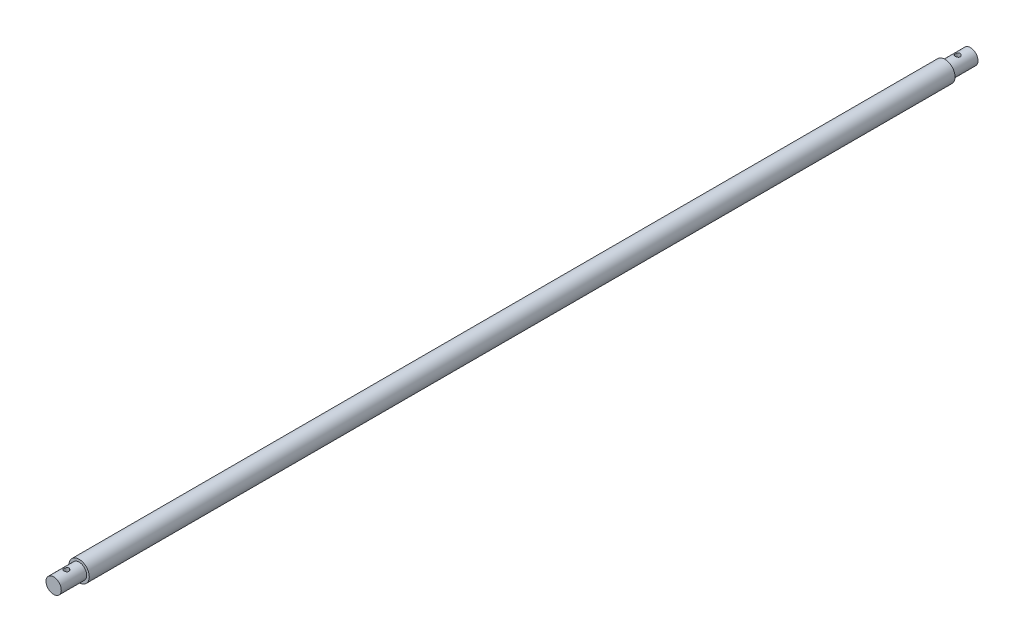
ISO-10303-21;
HEADER;
FILE_DESCRIPTION(('STEP AP214'),'2;1');
FILE_NAME('part.step','',(''),(''),'','','');
FILE_SCHEMA(('AUTOMOTIVE_DESIGN { 1 0 10303 214 1 1 1 1 }'));
ENDSEC;
DATA;
#1=APPLICATION_CONTEXT('core data for automotive mechanical design processes');
#2=APPLICATION_PROTOCOL_DEFINITION('international standard','automotive_design',2000,#1);
#3=PRODUCT_CONTEXT('',#1,'mechanical');
#4=PRODUCT('Part','Part','',(#3));
#5=PRODUCT_RELATED_PRODUCT_CATEGORY('part','',(#4));
#6=PRODUCT_DEFINITION_FORMATION('','',#4);
#7=PRODUCT_DEFINITION_CONTEXT('part definition',#1,'design');
#8=PRODUCT_DEFINITION('design','',#6,#7);
#9=PRODUCT_DEFINITION_SHAPE('','',#8);
#10=(LENGTH_UNIT() NAMED_UNIT(*) SI_UNIT(.MILLI.,.METRE.));
#11=(NAMED_UNIT(*) PLANE_ANGLE_UNIT() SI_UNIT($,.RADIAN.));
#12=(NAMED_UNIT(*) SI_UNIT($,.STERADIAN.) SOLID_ANGLE_UNIT());
#13=UNCERTAINTY_MEASURE_WITH_UNIT(LENGTH_MEASURE(1.E-05),#10,'distance_accuracy_value','');
#14=(GEOMETRIC_REPRESENTATION_CONTEXT(3) GLOBAL_UNCERTAINTY_ASSIGNED_CONTEXT((#13)) GLOBAL_UNIT_ASSIGNED_CONTEXT((#10,
#11,#12)) REPRESENTATION_CONTEXT('',''));
#15=CARTESIAN_POINT('',(0.,0.,0.));
#16=DIRECTION('',(0.,0.,1.));
#17=DIRECTION('',(1.,0.,0.));
#18=AXIS2_PLACEMENT_3D('',#15,#16,#17);
#19=CARTESIAN_POINT('',(0.,0.,350.));
#20=DIRECTION('',(0.,0.,-1.));
#21=DIRECTION('',(-1.,0.,0.));
#22=AXIS2_PLACEMENT_3D('',#19,#20,#21);
#23=CYLINDRICAL_SURFACE('',#22,4.);
#24=CARTESIAN_POINT('',(0.,0.,350.));
#25=DIRECTION('',(0.,0.,1.));
#26=DIRECTION('',(1.,0.,0.));
#27=AXIS2_PLACEMENT_3D('',#24,#25,#26);
#28=CIRCLE('',#27,4.);
#29=CARTESIAN_POINT('',(4.,0.,350.));
#30=VERTEX_POINT('',#29);
#31=EDGE_CURVE('E94',#30,#30,#28,.T.);
#32=ORIENTED_EDGE('',*,*,#31,.F.);
#33=EDGE_LOOP('',(#32));
#34=FACE_BOUND('',#33,.T.);
#35=CARTESIAN_POINT('',(0.,0.,10.));
#36=DIRECTION('',(0.,0.,-1.));
#37=DIRECTION('',(-1.,0.,0.));
#38=AXIS2_PLACEMENT_3D('',#35,#36,#37);
#39=CIRCLE('',#38,4.);
#40=CARTESIAN_POINT('',(-4.,0.,10.));
#41=VERTEX_POINT('',#40);
#42=EDGE_CURVE('E97',#41,#41,#39,.T.);
#43=ORIENTED_EDGE('',*,*,#42,.F.);
#44=EDGE_LOOP('',(#43));
#45=FACE_BOUND('',#44,.T.);
#46=ADVANCED_FACE('F33',(#34,#45),#23,.T.);
#47=CARTESIAN_POINT('',(0.,0.,360.));
#48=DIRECTION('',(0.,0.,-1.));
#49=DIRECTION('',(-1.,0.,0.));
#50=AXIS2_PLACEMENT_3D('',#47,#48,#49);
#51=CYLINDRICAL_SURFACE('',#50,3.);
#52=CARTESIAN_POINT('',(0.,0.,360.));
#53=DIRECTION('',(0.,0.,1.));
#54=DIRECTION('',(1.,0.,0.));
#55=AXIS2_PLACEMENT_3D('',#52,#53,#54);
#56=CIRCLE('',#55,3.);
#57=CARTESIAN_POINT('',(3.,0.,360.));
#58=VERTEX_POINT('',#57);
#59=EDGE_CURVE('E99',#58,#58,#56,.T.);
#60=ORIENTED_EDGE('',*,*,#59,.F.);
#61=EDGE_LOOP('',(#60));
#62=FACE_BOUND('',#61,.T.);
#63=CARTESIAN_POINT('',(0.,0.,350.));
#64=DIRECTION('',(0.,0.,1.));
#65=DIRECTION('',(1.,0.,0.));
#66=AXIS2_PLACEMENT_3D('',#63,#64,#65);
#67=CIRCLE('',#66,3.);
#68=CARTESIAN_POINT('',(3.,0.,350.));
#69=VERTEX_POINT('',#68);
#70=EDGE_CURVE('E50',#69,#69,#67,.T.);
#71=ORIENTED_EDGE('',*,*,#70,.T.);
#72=EDGE_LOOP('',(#71));
#73=FACE_BOUND('',#72,.T.);
#74=CARTESIAN_POINT('',(0.,-3.,354.));
#75=CARTESIAN_POINT('',(0.0545633628867246,-3.00000015300943,353.999999746268));
#76=CARTESIAN_POINT('',(0.109125194538551,-2.99849769507545,354.004480266127));
#77=CARTESIAN_POINT('',(0.216641760872975,-2.99265210203281,354.022229108817));
#78=CARTESIAN_POINT('',(0.269596328118821,-2.98830867202152,354.035498343949));
#79=CARTESIAN_POINT('',(0.372332789501775,-2.97725307906442,354.070319243384));
#80=CARTESIAN_POINT('',(0.422119825886028,-2.97054487730853,354.091857062459));
#81=CARTESIAN_POINT('',(0.51737493680532,-2.95544445717342,354.142541172838));
#82=CARTESIAN_POINT('',(0.562842156958707,-2.94705190667778,354.171688965003));
#83=CARTESIAN_POINT('',(0.649741675022275,-2.92914094443005,354.237825804859));
#84=CARTESIAN_POINT('',(0.691003700298319,-2.91959556463785,354.27503123426));
#85=CARTESIAN_POINT('',(0.766832692702094,-2.90060314783121,354.355767154707));
#86=CARTESIAN_POINT('',(0.801398185489472,-2.89115613290549,354.399299034929));
#87=CARTESIAN_POINT('',(0.863824942227867,-2.87313332477274,354.492985115196));
#88=CARTESIAN_POINT('',(0.891464858221039,-2.86459039275688,354.543293739732));
#89=CARTESIAN_POINT('',(0.937818873877725,-2.84975305418601,354.648176094459));
#90=CARTESIAN_POINT('',(0.956535697386764,-2.84345796160746,354.702748517163));
#91=CARTESIAN_POINT('',(0.983873461509152,-2.83411303269378,354.812673221497));
#92=CARTESIAN_POINT('',(0.992813448271757,-2.83096095769612,354.867937208489));
#93=CARTESIAN_POINT('',(1.00134112333448,-2.82795656629507,354.979263754156));
#94=CARTESIAN_POINT('',(1.00093170160473,-2.8281032302273,355.035326060709));
#95=CARTESIAN_POINT('',(0.991019903703425,-2.8315901500818,355.143936630444));
#96=CARTESIAN_POINT('',(0.981933913167002,-2.83478415867533,355.196528402919));
#97=CARTESIAN_POINT('',(0.955606162849432,-2.8437665772455,355.299393419607));
#98=CARTESIAN_POINT('',(0.938363426591883,-2.84955529784107,355.349666385435));
#99=CARTESIAN_POINT('',(0.895939058060217,-2.86317911131249,355.447412749591));
#100=CARTESIAN_POINT('',(0.870634048707269,-2.87104565793117,355.494828025469));
#101=CARTESIAN_POINT('',(0.81288910630314,-2.88792558575726,355.58487090828));
#102=CARTESIAN_POINT('',(0.780447112364001,-2.89693929790464,355.627497126933));
#103=CARTESIAN_POINT('',(0.707349332682231,-2.91567329167741,355.709091598161));
#104=CARTESIAN_POINT('',(0.666353150076308,-2.92540589354843,355.747752694509));
#105=CARTESIAN_POINT('',(0.578339569970055,-2.94406938387037,355.817731266663));
#106=CARTESIAN_POINT('',(0.531321595660798,-2.95300019538068,355.849048038164));
#107=CARTESIAN_POINT('',(0.431947613046251,-2.96917107937794,355.903696300235));
#108=CARTESIAN_POINT('',(0.379543276416329,-2.9763935000804,355.926945491341));
#109=CARTESIAN_POINT('',(0.27126908336452,-2.98820567144434,355.964203173956));
#110=CARTESIAN_POINT('',(0.21540043815498,-2.99279633654878,355.978214875423));
#111=CARTESIAN_POINT('',(0.104383829529338,-2.99867627071441,355.996055666022));
#112=CARTESIAN_POINT('',(0.0493095998648747,-3.00010001833731,356.000299809173));
#113=CARTESIAN_POINT('',(-0.0607750699602173,-2.99988902694825,355.999667326402));
#114=CARTESIAN_POINT('',(-0.115785519319633,-2.99825480419352,355.99479224002));
#115=CARTESIAN_POINT('',(-0.222519866304251,-2.99220024717114,355.976388092264));
#116=CARTESIAN_POINT('',(-0.274292806834848,-2.98786198711228,355.96311379395));
#117=CARTESIAN_POINT('',(-0.374855958579557,-2.97691846830034,355.928606555533));
#118=CARTESIAN_POINT('',(-0.423645788508559,-2.97031292046541,355.907372600532));
#119=CARTESIAN_POINT('',(-0.518288296393323,-2.95528931287427,355.856929568159));
#120=CARTESIAN_POINT('',(-0.56402995921733,-2.94682814756305,355.827525406716));
#121=CARTESIAN_POINT('',(-0.6500648301354,-2.92905253915743,355.761805849987));
#122=CARTESIAN_POINT('',(-0.690356367794889,-2.91973783591888,355.72548834397));
#123=CARTESIAN_POINT('',(-0.766252507807004,-2.90076847982473,355.645021248992));
#124=CARTESIAN_POINT('',(-0.80156096924848,-2.89111761095156,355.600590773067));
#125=CARTESIAN_POINT('',(-0.864257522320848,-2.87299973286981,355.506228432195));
#126=CARTESIAN_POINT('',(-0.891645547920843,-2.8645327335312,355.45629652139));
#127=CARTESIAN_POINT('',(-0.937596930423358,-2.84982391820308,355.352326984693));
#128=CARTESIAN_POINT('',(-0.956178132197761,-2.84357760900632,355.298297920757));
#129=CARTESIAN_POINT('',(-0.983894666792163,-2.83410832399133,355.187621349876));
#130=CARTESIAN_POINT('',(-0.993034254961246,-2.83088398622698,355.130975034567));
#131=CARTESIAN_POINT('',(-1.00127628247038,-2.82797858875071,355.019802903987));
#132=CARTESIAN_POINT('',(-1.00087025731093,-2.82812400344299,354.965317659748));
#133=CARTESIAN_POINT('',(-0.991242293454874,-2.8315126992356,354.8572349251));
#134=CARTESIAN_POINT('',(-0.982020879458884,-2.83475579595884,354.803637382047));
#135=CARTESIAN_POINT('',(-0.955371813126976,-2.84384524278944,354.699864336987));
#136=CARTESIAN_POINT('',(-0.938103346014871,-2.84964098015514,354.649643174993));
#137=CARTESIAN_POINT('',(-0.895979365760366,-2.86316398825434,354.552772593064));
#138=CARTESIAN_POINT('',(-0.871122168553967,-2.87089168765297,354.506123968813));
#139=CARTESIAN_POINT('',(-0.81326069258325,-2.8878282922406,354.415516330076));
#140=CARTESIAN_POINT('',(-0.77994824276454,-2.89708711641604,354.371763498101));
#141=CARTESIAN_POINT('',(-0.706642883135702,-2.91583356283786,354.290310186616));
#142=CARTESIAN_POINT('',(-0.666648084451491,-2.92532124912518,354.252611424312));
#143=CARTESIAN_POINT('',(-0.579241556920674,-2.94390030525393,354.182855587711));
#144=CARTESIAN_POINT('',(-0.531601513499736,-2.95296181801216,354.151075652249));
#145=CARTESIAN_POINT('',(-0.431357357406649,-2.96925991172652,354.096009571149));
#146=CARTESIAN_POINT('',(-0.378754518132368,-2.9764969590794,354.072721254078));
#147=CARTESIAN_POINT('',(-0.272493647200987,-2.98805515068532,354.036278367511));
#148=CARTESIAN_POINT('',(-0.218987757676417,-2.9924921242252,354.022717533737));
#149=CARTESIAN_POINT('',(-0.11032041601025,-2.99846407064224,354.004579719323));
#150=CARTESIAN_POINT('',(-0.0551594255687471,-2.99999984531906,354.000000256503));
#151=CARTESIAN_POINT('',(0.,-3.,354.));
#152=B_SPLINE_CURVE_WITH_KNOTS('',3,(#74,#75,#76,#77,#78,#79,#80,#81,#82,#83,#84,#85,#86,#87,
#88,#89,#90,#91,#92,#93,#94,#95,#96,#97,#98,#99,#100,#101,#102,#103,#104,#105,#106,#107,#108,
#109,#110,#111,#112,#113,#114,#115,#116,#117,#118,#119,#120,#121,#122,#123,#124,#125,#126,#127,
#128,#129,#130,#131,#132,#133,#134,#135,#136,#137,#138,#139,#140,#141,#142,#143,#144,#145,#146,
#147,#148,#149,#150,#151),.UNSPECIFIED.,.T.,.F.,(4,2,2,2,2,2,2,2,2,2,2,2,2,2,2,2,2,2,2,2,2,2,2,
2,2,2,2,2,2,2,2,2,2,2,2,2,2,2,4),(0.,0.163487106026015,0.32699118526752,0.490222672870258,
0.653486377799104,0.821846842827593,0.990244332875341,1.16348384823471,1.33667044692833,
1.50401925741828,1.67131633987481,1.83096826551271,1.99063930855483,2.15288171155132,
2.31517102558206,2.48593305811368,2.65671145966619,2.82918405650358,3.00159668877205,
3.16653583175167,3.33144713164176,3.49158157978213,3.65173645284104,3.81610399843737,
3.98052180821891,4.1524102288075,4.32430008234998,4.49584013824413,4.66730284700849,
4.82995666056625,4.99260079341191,5.15215587070237,5.31174638165789,5.47830066681619,
5.6449021111359,5.8179966082491,5.99104681142268,6.15636558363626,6.32163866027953),.UNSPECIFIED.);
#153=CARTESIAN_POINT('',(0.,-3.,354.));
#154=VERTEX_POINT('',#153);
#155=EDGE_CURVE('E45',#154,#154,#152,.T.);
#156=ORIENTED_EDGE('',*,*,#155,.F.);
#157=EDGE_LOOP('',(#156));
#158=FACE_BOUND('',#157,.T.);
#159=CARTESIAN_POINT('',(0.,3.,354.));
#160=CARTESIAN_POINT('',(-0.0545633628867246,3.00000015300943,353.999999746268));
#161=CARTESIAN_POINT('',(-0.109125194538551,2.99849769507545,354.004480266127));
#162=CARTESIAN_POINT('',(-0.216641760872975,2.99265210203281,354.022229108817));
#163=CARTESIAN_POINT('',(-0.269596328118821,2.98830867202152,354.035498343949));
#164=CARTESIAN_POINT('',(-0.372332789501775,2.97725307906442,354.070319243384));
#165=CARTESIAN_POINT('',(-0.422119825886028,2.97054487730853,354.091857062459));
#166=CARTESIAN_POINT('',(-0.51737493680532,2.95544445717342,354.142541172838));
#167=CARTESIAN_POINT('',(-0.562842156958707,2.94705190667778,354.171688965003));
#168=CARTESIAN_POINT('',(-0.649741675022275,2.92914094443005,354.237825804859));
#169=CARTESIAN_POINT('',(-0.691003700298319,2.91959556463785,354.27503123426));
#170=CARTESIAN_POINT('',(-0.766832692702094,2.90060314783121,354.355767154707));
#171=CARTESIAN_POINT('',(-0.801398185489472,2.89115613290549,354.399299034929));
#172=CARTESIAN_POINT('',(-0.863824942227867,2.87313332477274,354.492985115196));
#173=CARTESIAN_POINT('',(-0.891464858221039,2.86459039275688,354.543293739732));
#174=CARTESIAN_POINT('',(-0.937818873877725,2.84975305418601,354.648176094459));
#175=CARTESIAN_POINT('',(-0.956535697386764,2.84345796160746,354.702748517163));
#176=CARTESIAN_POINT('',(-0.983873461509152,2.83411303269378,354.812673221497));
#177=CARTESIAN_POINT('',(-0.992813448271757,2.83096095769612,354.867937208489));
#178=CARTESIAN_POINT('',(-1.00134112333448,2.82795656629507,354.979263754156));
#179=CARTESIAN_POINT('',(-1.00093170160473,2.8281032302273,355.035326060709));
#180=CARTESIAN_POINT('',(-0.991019903703425,2.8315901500818,355.143936630444));
#181=CARTESIAN_POINT('',(-0.981933913167002,2.83478415867533,355.196528402919));
#182=CARTESIAN_POINT('',(-0.955606162849432,2.8437665772455,355.299393419607));
#183=CARTESIAN_POINT('',(-0.938363426591883,2.84955529784107,355.349666385435));
#184=CARTESIAN_POINT('',(-0.895939058060217,2.86317911131249,355.447412749591));
#185=CARTESIAN_POINT('',(-0.870634048707269,2.87104565793117,355.494828025469));
#186=CARTESIAN_POINT('',(-0.81288910630314,2.88792558575726,355.58487090828));
#187=CARTESIAN_POINT('',(-0.780447112364001,2.89693929790464,355.627497126933));
#188=CARTESIAN_POINT('',(-0.707349332682231,2.91567329167741,355.709091598161));
#189=CARTESIAN_POINT('',(-0.666353150076308,2.92540589354843,355.747752694509));
#190=CARTESIAN_POINT('',(-0.578339569970055,2.94406938387037,355.817731266663));
#191=CARTESIAN_POINT('',(-0.531321595660798,2.95300019538068,355.849048038164));
#192=CARTESIAN_POINT('',(-0.431947613046251,2.96917107937794,355.903696300235));
#193=CARTESIAN_POINT('',(-0.379543276416329,2.9763935000804,355.926945491341));
#194=CARTESIAN_POINT('',(-0.27126908336452,2.98820567144434,355.964203173956));
#195=CARTESIAN_POINT('',(-0.21540043815498,2.99279633654878,355.978214875423));
#196=CARTESIAN_POINT('',(-0.104383829529338,2.99867627071441,355.996055666022));
#197=CARTESIAN_POINT('',(-0.0493095998648747,3.00010001833731,356.000299809173));
#198=CARTESIAN_POINT('',(0.0607750699602173,2.99988902694825,355.999667326402));
#199=CARTESIAN_POINT('',(0.115785519319633,2.99825480419352,355.99479224002));
#200=CARTESIAN_POINT('',(0.222519866304251,2.99220024717114,355.976388092264));
#201=CARTESIAN_POINT('',(0.274292806834848,2.98786198711228,355.96311379395));
#202=CARTESIAN_POINT('',(0.374855958579557,2.97691846830034,355.928606555533));
#203=CARTESIAN_POINT('',(0.423645788508559,2.97031292046541,355.907372600532));
#204=CARTESIAN_POINT('',(0.518288296393323,2.95528931287427,355.856929568159));
#205=CARTESIAN_POINT('',(0.56402995921733,2.94682814756305,355.827525406716));
#206=CARTESIAN_POINT('',(0.6500648301354,2.92905253915743,355.761805849987));
#207=CARTESIAN_POINT('',(0.690356367794889,2.91973783591888,355.72548834397));
#208=CARTESIAN_POINT('',(0.766252507807004,2.90076847982473,355.645021248992));
#209=CARTESIAN_POINT('',(0.80156096924848,2.89111761095156,355.600590773067));
#210=CARTESIAN_POINT('',(0.864257522320848,2.87299973286981,355.506228432195));
#211=CARTESIAN_POINT('',(0.891645547920843,2.8645327335312,355.45629652139));
#212=CARTESIAN_POINT('',(0.937596930423358,2.84982391820308,355.352326984693));
#213=CARTESIAN_POINT('',(0.956178132197761,2.84357760900632,355.298297920757));
#214=CARTESIAN_POINT('',(0.983894666792163,2.83410832399133,355.187621349876));
#215=CARTESIAN_POINT('',(0.993034254961246,2.83088398622698,355.130975034567));
#216=CARTESIAN_POINT('',(1.00127628247038,2.82797858875071,355.019802903987));
#217=CARTESIAN_POINT('',(1.00087025731093,2.82812400344299,354.965317659748));
#218=CARTESIAN_POINT('',(0.991242293454874,2.8315126992356,354.8572349251));
#219=CARTESIAN_POINT('',(0.982020879458884,2.83475579595884,354.803637382047));
#220=CARTESIAN_POINT('',(0.955371813126976,2.84384524278944,354.699864336987));
#221=CARTESIAN_POINT('',(0.938103346014871,2.84964098015514,354.649643174993));
#222=CARTESIAN_POINT('',(0.895979365760366,2.86316398825434,354.552772593064));
#223=CARTESIAN_POINT('',(0.871122168553967,2.87089168765297,354.506123968813));
#224=CARTESIAN_POINT('',(0.81326069258325,2.8878282922406,354.415516330076));
#225=CARTESIAN_POINT('',(0.77994824276454,2.89708711641604,354.371763498101));
#226=CARTESIAN_POINT('',(0.706642883135702,2.91583356283786,354.290310186616));
#227=CARTESIAN_POINT('',(0.666648084451491,2.92532124912518,354.252611424312));
#228=CARTESIAN_POINT('',(0.579241556920674,2.94390030525393,354.182855587711));
#229=CARTESIAN_POINT('',(0.531601513499736,2.95296181801216,354.151075652249));
#230=CARTESIAN_POINT('',(0.431357357406649,2.96925991172652,354.096009571149));
#231=CARTESIAN_POINT('',(0.378754518132368,2.9764969590794,354.072721254078));
#232=CARTESIAN_POINT('',(0.272493647200987,2.98805515068532,354.036278367511));
#233=CARTESIAN_POINT('',(0.218987757676417,2.9924921242252,354.022717533737));
#234=CARTESIAN_POINT('',(0.11032041601025,2.99846407064224,354.004579719323));
#235=CARTESIAN_POINT('',(0.0551594255687471,2.99999984531906,354.000000256503));
#236=CARTESIAN_POINT('',(0.,3.,354.));
#237=B_SPLINE_CURVE_WITH_KNOTS('',3,(#159,#160,#161,#162,#163,#164,#165,#166,#167,#168,#169,
#170,#171,#172,#173,#174,#175,#176,#177,#178,#179,#180,#181,#182,#183,#184,#185,#186,#187,#188,
#189,#190,#191,#192,#193,#194,#195,#196,#197,#198,#199,#200,#201,#202,#203,#204,#205,#206,#207,
#208,#209,#210,#211,#212,#213,#214,#215,#216,#217,#218,#219,#220,#221,#222,#223,#224,#225,#226,
#227,#228,#229,#230,#231,#232,#233,#234,#235,#236),.UNSPECIFIED.,.T.,.F.,(4,2,2,2,2,2,2,2,2,2,2,
2,2,2,2,2,2,2,2,2,2,2,2,2,2,2,2,2,2,2,2,2,2,2,2,2,2,2,4),(0.,0.163487106026015,0.32699118526752,
0.490222672870258,0.653486377799104,0.821846842827593,0.990244332875341,1.16348384823471,
1.33667044692833,1.50401925741828,1.67131633987481,1.83096826551271,1.99063930855483,
2.15288171155132,2.31517102558206,2.48593305811368,2.65671145966619,2.82918405650358,
3.00159668877205,3.16653583175167,3.33144713164176,3.49158157978213,3.65173645284104,
3.81610399843737,3.98052180821891,4.1524102288075,4.32430008234998,4.49584013824413,
4.66730284700849,4.82995666056625,4.99260079341191,5.15215587070237,5.31174638165789,
5.47830066681619,5.6449021111359,5.8179966082491,5.99104681142268,6.15636558363626,
6.32163866027953),.UNSPECIFIED.);
#238=CARTESIAN_POINT('',(0.,3.,354.));
#239=VERTEX_POINT('',#238);
#240=EDGE_CURVE('E10',#239,#239,#237,.T.);
#241=ORIENTED_EDGE('',*,*,#240,.F.);
#242=EDGE_LOOP('',(#241));
#243=FACE_BOUND('',#242,.T.);
#244=ADVANCED_FACE('F65',(#62,#73,#158,#243),#51,.T.);
#245=CARTESIAN_POINT('',(0.,0.,350.));
#246=DIRECTION('',(0.,0.,1.));
#247=DIRECTION('',(1.,0.,0.));
#248=AXIS2_PLACEMENT_3D('',#245,#246,#247);
#249=PLANE('',#248);
#250=ORIENTED_EDGE('',*,*,#70,.F.);
#251=EDGE_LOOP('',(#250));
#252=FACE_BOUND('',#251,.T.);
#253=ORIENTED_EDGE('',*,*,#31,.T.);
#254=EDGE_LOOP('',(#253));
#255=FACE_BOUND('',#254,.T.);
#256=ADVANCED_FACE('F78',(#252,#255),#249,.T.);
#257=CARTESIAN_POINT('',(0.,0.,360.));
#258=DIRECTION('',(0.,0.,1.));
#259=DIRECTION('',(1.,0.,0.));
#260=AXIS2_PLACEMENT_3D('',#257,#258,#259);
#261=PLANE('',#260);
#262=ORIENTED_EDGE('',*,*,#59,.T.);
#263=EDGE_LOOP('',(#262));
#264=FACE_BOUND('',#263,.T.);
#265=ADVANCED_FACE('F74',(#264),#261,.T.);
#266=CARTESIAN_POINT('',(0.,3.,355.));
#267=DIRECTION('',(0.,-1.,0.));
#268=DIRECTION('',(0.,0.,-1.));
#269=AXIS2_PLACEMENT_3D('',#266,#267,#268);
#270=CYLINDRICAL_SURFACE('',#269,1.);
#271=ORIENTED_EDGE('',*,*,#155,.T.);
#272=EDGE_LOOP('',(#271));
#273=FACE_BOUND('',#272,.T.);
#274=ORIENTED_EDGE('',*,*,#240,.T.);
#275=EDGE_LOOP('',(#274));
#276=FACE_BOUND('',#275,.T.);
#277=ADVANCED_FACE('F69',(#273,#276),#270,.F.);
#278=CARTESIAN_POINT('',(0.,0.,10.));
#279=DIRECTION('',(0.,0.,-1.));
#280=DIRECTION('',(-1.,0.,0.));
#281=AXIS2_PLACEMENT_3D('',#278,#279,#280);
#282=PLANE('',#281);
#283=CARTESIAN_POINT('',(0.,0.,10.));
#284=DIRECTION('',(0.,0.,-1.));
#285=DIRECTION('',(-1.,0.,0.));
#286=AXIS2_PLACEMENT_3D('',#283,#284,#285);
#287=CIRCLE('',#286,3.);
#288=CARTESIAN_POINT('',(-3.,0.,10.));
#289=VERTEX_POINT('',#288);
#290=EDGE_CURVE('E100',#289,#289,#287,.T.);
#291=ORIENTED_EDGE('',*,*,#290,.F.);
#292=EDGE_LOOP('',(#291));
#293=FACE_BOUND('',#292,.T.);
#294=ORIENTED_EDGE('',*,*,#42,.T.);
#295=EDGE_LOOP('',(#294));
#296=FACE_BOUND('',#295,.T.);
#297=ADVANCED_FACE('F73',(#293,#296),#282,.T.);
#298=CARTESIAN_POINT('',(0.,0.,10.));
#299=DIRECTION('',(0.,0.,-1.));
#300=DIRECTION('',(-1.,0.,0.));
#301=AXIS2_PLACEMENT_3D('',#298,#299,#300);
#302=CYLINDRICAL_SURFACE('',#301,3.);
#303=CARTESIAN_POINT('',(0.,-3.,6.));
#304=CARTESIAN_POINT('',(-0.0545633628867233,-3.00000015300943,6.00000025373164));
#305=CARTESIAN_POINT('',(-0.10912519453855,-2.99849769507545,5.99551973387278));
#306=CARTESIAN_POINT('',(-0.216641760872972,-2.99265210203281,5.97777089118278));
#307=CARTESIAN_POINT('',(-0.269596328118818,-2.98830867202153,5.96450165605108));
#308=CARTESIAN_POINT('',(-0.372332789501776,-2.97725307906443,5.92968075661595));
#309=CARTESIAN_POINT('',(-0.422119825886034,-2.97054487730853,5.90814293754073));
#310=CARTESIAN_POINT('',(-0.517374936805325,-2.95544445717342,5.85745882716165));
#311=CARTESIAN_POINT('',(-0.562842156958706,-2.94705190667778,5.8283110349974));
#312=CARTESIAN_POINT('',(-0.649741675022266,-2.92914094443005,5.76217419514125));
#313=CARTESIAN_POINT('',(-0.691003700298309,-2.91959556463785,5.72496876573951));
#314=CARTESIAN_POINT('',(-0.766832692702084,-2.90060314783121,5.64423284529343));
#315=CARTESIAN_POINT('',(-0.801398185489462,-2.89115613290549,5.60070096507149));
#316=CARTESIAN_POINT('',(-0.863824942227859,-2.87313332477274,5.50701488480354));
#317=CARTESIAN_POINT('',(-0.891464858221032,-2.86459039275688,5.45670626026788));
#318=CARTESIAN_POINT('',(-0.937818873877721,-2.84975305418601,5.35182390554145));
#319=CARTESIAN_POINT('',(-0.956535697386765,-2.84345796160746,5.29725148283726));
#320=CARTESIAN_POINT('',(-0.983873461509163,-2.83411303269377,5.18732677850329));
#321=CARTESIAN_POINT('',(-0.992813448271769,-2.83096095769611,5.13206279151093));
#322=CARTESIAN_POINT('',(-1.00134112333448,-2.82795656629507,5.02073624584412));
#323=CARTESIAN_POINT('',(-1.00093170160472,-2.8281032302273,4.96467393929081));
#324=CARTESIAN_POINT('',(-0.991019903703419,-2.8315901500818,4.85606336955598));
#325=CARTESIAN_POINT('',(-0.981933913166994,-2.83478415867533,4.80347159708098));
#326=CARTESIAN_POINT('',(-0.955606162849417,-2.84376657724551,4.70060658039317));
#327=CARTESIAN_POINT('',(-0.938363426591871,-2.84955529784108,4.65033361456493));
#328=CARTESIAN_POINT('',(-0.895939058060211,-2.86317911131249,4.55258725040852));
#329=CARTESIAN_POINT('',(-0.870634048707262,-2.87104565793117,4.50517197453047));
#330=CARTESIAN_POINT('',(-0.812889106303138,-2.88792558575726,4.41512909172027));
#331=CARTESIAN_POINT('',(-0.780447112364005,-2.89693929790464,4.37250287306662));
#332=CARTESIAN_POINT('',(-0.707349332682237,-2.91567329167741,4.29090840183923));
#333=CARTESIAN_POINT('',(-0.66635315007631,-2.92540589354843,4.25224730549093));
#334=CARTESIAN_POINT('',(-0.578339569970063,-2.94406938387037,4.1822687333366));
#335=CARTESIAN_POINT('',(-0.531321595660814,-2.95300019538067,4.1509519618355));
#336=CARTESIAN_POINT('',(-0.431947613046267,-2.96917107937794,4.09630369976493));
#337=CARTESIAN_POINT('',(-0.379543276416336,-2.97639350008039,4.07305450865927));
#338=CARTESIAN_POINT('',(-0.271269083364507,-2.98820567144435,4.03579682604429));
#339=CARTESIAN_POINT('',(-0.215400438154954,-2.99279633654878,4.02178512457656));
#340=CARTESIAN_POINT('',(-0.104383829529303,-2.99867627071441,4.00394433397764));
#341=CARTESIAN_POINT('',(-0.049309599864845,-3.00010001833731,3.99970019082725));
#342=CARTESIAN_POINT('',(0.0607750699602365,-2.99988902694825,4.00033267359847));
#343=CARTESIAN_POINT('',(0.115785519319647,-2.99825480419352,4.00520775997987));
#344=CARTESIAN_POINT('',(0.222519866304259,-2.99220024717114,4.02361190773597));
#345=CARTESIAN_POINT('',(0.274292806834856,-2.98786198711228,4.03688620604952));
#346=CARTESIAN_POINT('',(0.374855958579561,-2.97691846830034,4.0713934444667));
#347=CARTESIAN_POINT('',(0.423645788508559,-2.97031292046541,4.09262739946768));
#348=CARTESIAN_POINT('',(0.518288296393321,-2.95528931287427,4.1430704318409));
#349=CARTESIAN_POINT('',(0.56402995921733,-2.94682814756305,4.1724745932836));
#350=CARTESIAN_POINT('',(0.650064830135404,-2.92905253915743,4.23819415001305));
#351=CARTESIAN_POINT('',(0.690356367794894,-2.91973783591888,4.27451165603016));
#352=CARTESIAN_POINT('',(0.766252507807013,-2.90076847982472,4.35497875100826));
#353=CARTESIAN_POINT('',(0.801560969248491,-2.89111761095155,4.39940922693325));
#354=CARTESIAN_POINT('',(0.864257522320854,-2.87299973286981,4.4937715678045));
#355=CARTESIAN_POINT('',(0.891645547920843,-2.8645327335312,4.5437034786102));
#356=CARTESIAN_POINT('',(0.937596930423361,-2.84982391820308,4.6476730153066));
#357=CARTESIAN_POINT('',(0.956178132197766,-2.84357760900632,4.70170207924278));
#358=CARTESIAN_POINT('',(0.983894666792162,-2.83410832399133,4.81237865012415));
#359=CARTESIAN_POINT('',(0.993034254961243,-2.83088398622698,4.86902496543306));
#360=CARTESIAN_POINT('',(1.00127628247038,-2.82797858875071,4.98019709601321));
#361=CARTESIAN_POINT('',(1.00087025731093,-2.82812400344299,5.03468234025174));
#362=CARTESIAN_POINT('',(0.991242293454878,-2.8315126992356,5.14276507489974));
#363=CARTESIAN_POINT('',(0.982020879458886,-2.83475579595884,5.19636261795291));
#364=CARTESIAN_POINT('',(0.95537181312698,-2.84384524278943,5.30013566301267));
#365=CARTESIAN_POINT('',(0.93810334601488,-2.84964098015514,5.35035682500723));
#366=CARTESIAN_POINT('',(0.895979365760382,-2.86316398825433,5.44722740693553));
#367=CARTESIAN_POINT('',(0.871122168553979,-2.87089168765297,5.49387603118726));
#368=CARTESIAN_POINT('',(0.813260692583248,-2.8878282922406,5.58448366992369));
#369=CARTESIAN_POINT('',(0.779948242764531,-2.89708711641604,5.6282365018986));
#370=CARTESIAN_POINT('',(0.706642883135697,-2.91583356283786,5.70968981338399));
#371=CARTESIAN_POINT('',(0.666648084451494,-2.92532124912518,5.74738857568802));
#372=CARTESIAN_POINT('',(0.579241556920674,-2.94390030525393,5.81714441228924));
#373=CARTESIAN_POINT('',(0.531601513499725,-2.95296181801216,5.84892434775102));
#374=CARTESIAN_POINT('',(0.431357357406628,-2.96925991172652,5.90399042885063));
#375=CARTESIAN_POINT('',(0.378754518132349,-2.9764969590794,5.92727874592204));
#376=CARTESIAN_POINT('',(0.272493647200975,-2.98805515068532,5.96372163248868));
#377=CARTESIAN_POINT('',(0.218987757676408,-2.9924921242252,5.97728246626338));
#378=CARTESIAN_POINT('',(0.110320416010247,-2.99846407064224,5.99542028067713));
#379=CARTESIAN_POINT('',(0.0551594255687463,-2.99999984531906,5.99999974349654));
#380=CARTESIAN_POINT('',(0.,-3.,6.));
#381=B_SPLINE_CURVE_WITH_KNOTS('',3,(#303,#304,#305,#306,#307,#308,#309,#310,#311,#312,#313,
#314,#315,#316,#317,#318,#319,#320,#321,#322,#323,#324,#325,#326,#327,#328,#329,#330,#331,#332,
#333,#334,#335,#336,#337,#338,#339,#340,#341,#342,#343,#344,#345,#346,#347,#348,#349,#350,#351,
#352,#353,#354,#355,#356,#357,#358,#359,#360,#361,#362,#363,#364,#365,#366,#367,#368,#369,#370,
#371,#372,#373,#374,#375,#376,#377,#378,#379,#380),.UNSPECIFIED.,.T.,.F.,(4,2,2,2,2,2,2,2,2,2,2,
2,2,2,2,2,2,2,2,2,2,2,2,2,2,2,2,2,2,2,2,2,2,2,2,2,2,2,4),(0.,0.163487106026011,
0.326991185267521,0.490222672870274,0.6534863777991,0.82184684282756,0.990244332875302,
1.1634838482347,1.33667044692833,1.5040192574184,1.67131633987485,1.8309682655128,
1.99063930855482,2.15288171155131,2.31517102558207,2.48593305811367,2.65671145966618,
2.82918405650357,3.00159668877208,3.1665358317517,3.33144713164176,3.49158157978213,
3.65173645284104,3.81610399843736,3.98052180821891,4.15241022880752,4.32430008234997,
4.49584013824416,4.66730284700846,4.82995666056619,4.99260079341185,5.15215587070227,
5.31174638165787,5.47830066681614,5.64490211113589,5.8179966082491,5.99104681142266,
6.15636558363623,6.3216386602795),.UNSPECIFIED.);
#382=CARTESIAN_POINT('',(0.,-3.,6.));
#383=VERTEX_POINT('',#382);
#384=EDGE_CURVE('E36',#383,#383,#381,.T.);
#385=ORIENTED_EDGE('',*,*,#384,.F.);
#386=EDGE_LOOP('',(#385));
#387=FACE_BOUND('',#386,.T.);
#388=CARTESIAN_POINT('',(0.,3.,6.));
#389=CARTESIAN_POINT('',(0.0545633628867233,3.00000015300943,6.00000025373164));
#390=CARTESIAN_POINT('',(0.10912519453855,2.99849769507545,5.99551973387278));
#391=CARTESIAN_POINT('',(0.216641760872972,2.99265210203281,5.97777089118278));
#392=CARTESIAN_POINT('',(0.269596328118818,2.98830867202153,5.96450165605108));
#393=CARTESIAN_POINT('',(0.372332789501776,2.97725307906443,5.92968075661595));
#394=CARTESIAN_POINT('',(0.422119825886034,2.97054487730853,5.90814293754073));
#395=CARTESIAN_POINT('',(0.517374936805325,2.95544445717342,5.85745882716165));
#396=CARTESIAN_POINT('',(0.562842156958706,2.94705190667778,5.8283110349974));
#397=CARTESIAN_POINT('',(0.649741675022266,2.92914094443005,5.76217419514125));
#398=CARTESIAN_POINT('',(0.691003700298309,2.91959556463785,5.72496876573951));
#399=CARTESIAN_POINT('',(0.766832692702084,2.90060314783121,5.64423284529343));
#400=CARTESIAN_POINT('',(0.801398185489462,2.89115613290549,5.60070096507149));
#401=CARTESIAN_POINT('',(0.863824942227859,2.87313332477274,5.50701488480354));
#402=CARTESIAN_POINT('',(0.891464858221032,2.86459039275688,5.45670626026788));
#403=CARTESIAN_POINT('',(0.937818873877721,2.84975305418601,5.35182390554145));
#404=CARTESIAN_POINT('',(0.956535697386765,2.84345796160746,5.29725148283726));
#405=CARTESIAN_POINT('',(0.983873461509163,2.83411303269377,5.18732677850329));
#406=CARTESIAN_POINT('',(0.992813448271769,2.83096095769611,5.13206279151093));
#407=CARTESIAN_POINT('',(1.00134112333448,2.82795656629507,5.02073624584412));
#408=CARTESIAN_POINT('',(1.00093170160472,2.8281032302273,4.96467393929081));
#409=CARTESIAN_POINT('',(0.991019903703419,2.8315901500818,4.85606336955598));
#410=CARTESIAN_POINT('',(0.981933913166994,2.83478415867533,4.80347159708098));
#411=CARTESIAN_POINT('',(0.955606162849417,2.84376657724551,4.70060658039317));
#412=CARTESIAN_POINT('',(0.938363426591871,2.84955529784108,4.65033361456493));
#413=CARTESIAN_POINT('',(0.895939058060211,2.86317911131249,4.55258725040852));
#414=CARTESIAN_POINT('',(0.870634048707262,2.87104565793117,4.50517197453047));
#415=CARTESIAN_POINT('',(0.812889106303138,2.88792558575726,4.41512909172027));
#416=CARTESIAN_POINT('',(0.780447112364005,2.89693929790464,4.37250287306662));
#417=CARTESIAN_POINT('',(0.707349332682237,2.91567329167741,4.29090840183923));
#418=CARTESIAN_POINT('',(0.66635315007631,2.92540589354843,4.25224730549093));
#419=CARTESIAN_POINT('',(0.578339569970063,2.94406938387037,4.1822687333366));
#420=CARTESIAN_POINT('',(0.531321595660814,2.95300019538067,4.1509519618355));
#421=CARTESIAN_POINT('',(0.431947613046267,2.96917107937794,4.09630369976493));
#422=CARTESIAN_POINT('',(0.379543276416336,2.97639350008039,4.07305450865927));
#423=CARTESIAN_POINT('',(0.271269083364507,2.98820567144435,4.03579682604429));
#424=CARTESIAN_POINT('',(0.215400438154954,2.99279633654878,4.02178512457656));
#425=CARTESIAN_POINT('',(0.104383829529303,2.99867627071441,4.00394433397764));
#426=CARTESIAN_POINT('',(0.049309599864845,3.00010001833731,3.99970019082725));
#427=CARTESIAN_POINT('',(-0.0607750699602365,2.99988902694825,4.00033267359847));
#428=CARTESIAN_POINT('',(-0.115785519319647,2.99825480419352,4.00520775997987));
#429=CARTESIAN_POINT('',(-0.222519866304259,2.99220024717114,4.02361190773597));
#430=CARTESIAN_POINT('',(-0.274292806834856,2.98786198711228,4.03688620604952));
#431=CARTESIAN_POINT('',(-0.374855958579561,2.97691846830034,4.0713934444667));
#432=CARTESIAN_POINT('',(-0.423645788508559,2.97031292046541,4.09262739946768));
#433=CARTESIAN_POINT('',(-0.518288296393321,2.95528931287427,4.1430704318409));
#434=CARTESIAN_POINT('',(-0.56402995921733,2.94682814756305,4.1724745932836));
#435=CARTESIAN_POINT('',(-0.650064830135404,2.92905253915743,4.23819415001305));
#436=CARTESIAN_POINT('',(-0.690356367794894,2.91973783591888,4.27451165603016));
#437=CARTESIAN_POINT('',(-0.766252507807013,2.90076847982472,4.35497875100826));
#438=CARTESIAN_POINT('',(-0.801560969248491,2.89111761095155,4.39940922693325));
#439=CARTESIAN_POINT('',(-0.864257522320854,2.87299973286981,4.4937715678045));
#440=CARTESIAN_POINT('',(-0.891645547920843,2.8645327335312,4.5437034786102));
#441=CARTESIAN_POINT('',(-0.937596930423361,2.84982391820308,4.6476730153066));
#442=CARTESIAN_POINT('',(-0.956178132197766,2.84357760900632,4.70170207924278));
#443=CARTESIAN_POINT('',(-0.983894666792162,2.83410832399133,4.81237865012415));
#444=CARTESIAN_POINT('',(-0.993034254961243,2.83088398622698,4.86902496543306));
#445=CARTESIAN_POINT('',(-1.00127628247038,2.82797858875071,4.98019709601321));
#446=CARTESIAN_POINT('',(-1.00087025731093,2.82812400344299,5.03468234025174));
#447=CARTESIAN_POINT('',(-0.991242293454878,2.8315126992356,5.14276507489974));
#448=CARTESIAN_POINT('',(-0.982020879458886,2.83475579595884,5.19636261795291));
#449=CARTESIAN_POINT('',(-0.95537181312698,2.84384524278943,5.30013566301267));
#450=CARTESIAN_POINT('',(-0.93810334601488,2.84964098015514,5.35035682500723));
#451=CARTESIAN_POINT('',(-0.895979365760382,2.86316398825433,5.44722740693553));
#452=CARTESIAN_POINT('',(-0.871122168553979,2.87089168765297,5.49387603118726));
#453=CARTESIAN_POINT('',(-0.813260692583248,2.8878282922406,5.58448366992369));
#454=CARTESIAN_POINT('',(-0.779948242764531,2.89708711641604,5.6282365018986));
#455=CARTESIAN_POINT('',(-0.706642883135697,2.91583356283786,5.70968981338399));
#456=CARTESIAN_POINT('',(-0.666648084451494,2.92532124912518,5.74738857568802));
#457=CARTESIAN_POINT('',(-0.579241556920674,2.94390030525393,5.81714441228924));
#458=CARTESIAN_POINT('',(-0.531601513499725,2.95296181801216,5.84892434775102));
#459=CARTESIAN_POINT('',(-0.431357357406628,2.96925991172652,5.90399042885063));
#460=CARTESIAN_POINT('',(-0.378754518132349,2.9764969590794,5.92727874592204));
#461=CARTESIAN_POINT('',(-0.272493647200975,2.98805515068532,5.96372163248868));
#462=CARTESIAN_POINT('',(-0.218987757676408,2.9924921242252,5.97728246626338));
#463=CARTESIAN_POINT('',(-0.110320416010247,2.99846407064224,5.99542028067713));
#464=CARTESIAN_POINT('',(-0.0551594255687463,2.99999984531906,5.99999974349654));
#465=CARTESIAN_POINT('',(0.,3.,6.));
#466=B_SPLINE_CURVE_WITH_KNOTS('',3,(#388,#389,#390,#391,#392,#393,#394,#395,#396,#397,#398,
#399,#400,#401,#402,#403,#404,#405,#406,#407,#408,#409,#410,#411,#412,#413,#414,#415,#416,#417,
#418,#419,#420,#421,#422,#423,#424,#425,#426,#427,#428,#429,#430,#431,#432,#433,#434,#435,#436,
#437,#438,#439,#440,#441,#442,#443,#444,#445,#446,#447,#448,#449,#450,#451,#452,#453,#454,#455,
#456,#457,#458,#459,#460,#461,#462,#463,#464,#465),.UNSPECIFIED.,.T.,.F.,(4,2,2,2,2,2,2,2,2,2,2,
2,2,2,2,2,2,2,2,2,2,2,2,2,2,2,2,2,2,2,2,2,2,2,2,2,2,2,4),(0.,0.163487106026011,
0.326991185267521,0.490222672870274,0.6534863777991,0.82184684282756,0.990244332875302,
1.1634838482347,1.33667044692833,1.5040192574184,1.67131633987485,1.8309682655128,
1.99063930855482,2.15288171155131,2.31517102558207,2.48593305811367,2.65671145966618,
2.82918405650357,3.00159668877208,3.1665358317517,3.33144713164176,3.49158157978213,
3.65173645284104,3.81610399843736,3.98052180821891,4.15241022880752,4.32430008234997,
4.49584013824416,4.66730284700846,4.82995666056619,4.99260079341185,5.15215587070227,
5.31174638165787,5.47830066681614,5.64490211113589,5.8179966082491,5.99104681142266,
6.15636558363623,6.3216386602795),.UNSPECIFIED.);
#467=CARTESIAN_POINT('',(0.,3.,6.));
#468=VERTEX_POINT('',#467);
#469=EDGE_CURVE('E61',#468,#468,#466,.T.);
#470=ORIENTED_EDGE('',*,*,#469,.F.);
#471=EDGE_LOOP('',(#470));
#472=FACE_BOUND('',#471,.T.);
#473=ORIENTED_EDGE('',*,*,#290,.T.);
#474=EDGE_LOOP('',(#473));
#475=FACE_BOUND('',#474,.T.);
#476=CARTESIAN_POINT('',(0.,0.,0.));
#477=DIRECTION('',(0.,0.,-1.));
#478=DIRECTION('',(-1.,0.,0.));
#479=AXIS2_PLACEMENT_3D('',#476,#477,#478);
#480=CIRCLE('',#479,3.);
#481=CARTESIAN_POINT('',(-3.,0.,0.));
#482=VERTEX_POINT('',#481);
#483=EDGE_CURVE('E104',#482,#482,#480,.T.);
#484=ORIENTED_EDGE('',*,*,#483,.F.);
#485=EDGE_LOOP('',(#484));
#486=FACE_BOUND('',#485,.T.);
#487=ADVANCED_FACE('F126',(#387,#472,#475,#486),#302,.T.);
#488=CARTESIAN_POINT('',(0.,0.,0.));
#489=DIRECTION('',(0.,0.,1.));
#490=DIRECTION('',(1.,0.,0.));
#491=AXIS2_PLACEMENT_3D('',#488,#489,#490);
#492=PLANE('',#491);
#493=ORIENTED_EDGE('',*,*,#483,.T.);
#494=EDGE_LOOP('',(#493));
#495=FACE_BOUND('',#494,.T.);
#496=ADVANCED_FACE('F129',(#495),#492,.F.);
#497=CARTESIAN_POINT('',(0.,-4.,5.));
#498=DIRECTION('',(0.,1.,0.));
#499=DIRECTION('',(0.,0.,1.));
#500=AXIS2_PLACEMENT_3D('',#497,#498,#499);
#501=CYLINDRICAL_SURFACE('',#500,1.);
#502=ORIENTED_EDGE('',*,*,#384,.T.);
#503=EDGE_LOOP('',(#502));
#504=FACE_BOUND('',#503,.T.);
#505=ORIENTED_EDGE('',*,*,#469,.T.);
#506=EDGE_LOOP('',(#505));
#507=FACE_BOUND('',#506,.T.);
#508=ADVANCED_FACE('F124',(#504,#507),#501,.F.);
#509=CLOSED_SHELL('',(#46,#244,#256,#265,#277,#297,#487,#496,#508));
#510=MANIFOLD_SOLID_BREP('B2',#509);
#511=ADVANCED_BREP_SHAPE_REPRESENTATION('',(#18,#510),#14);
#512=SHAPE_DEFINITION_REPRESENTATION(#9,#511);
ENDSEC;
END-ISO-10303-21;
